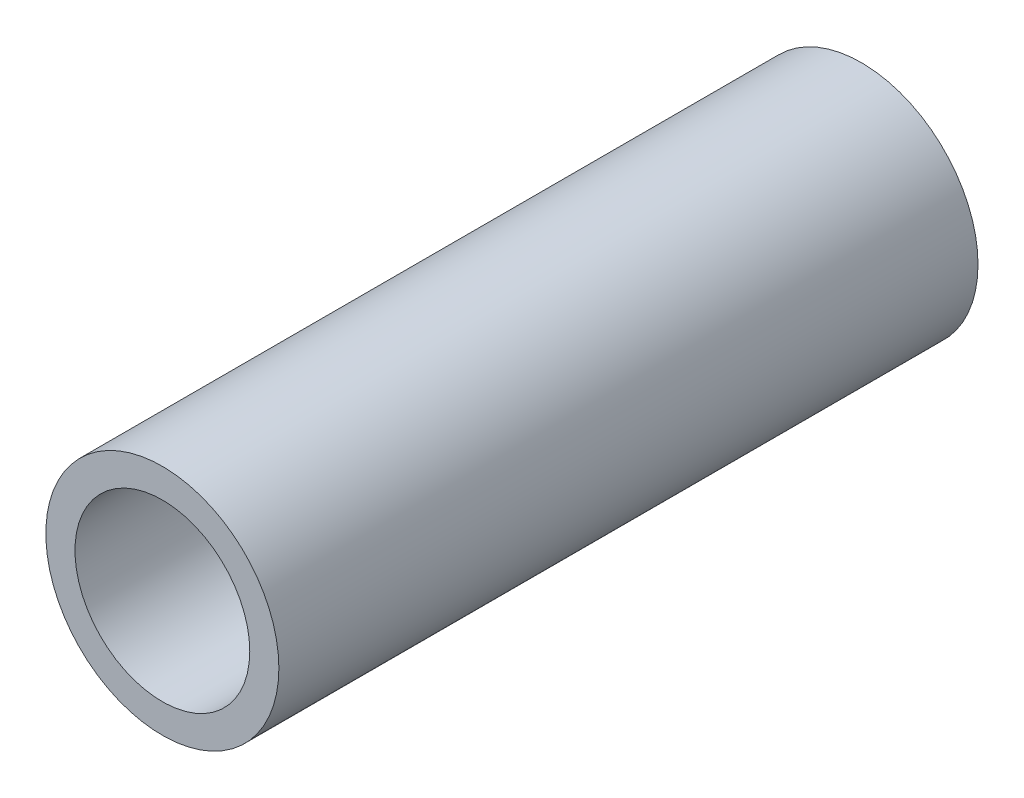
ISO-10303-21;
HEADER;
FILE_DESCRIPTION(('STEP AP214'),'2;1');
FILE_NAME('part.step','',(''),(''),'','','');
FILE_SCHEMA(('AUTOMOTIVE_DESIGN { 1 0 10303 214 1 1 1 1 }'));
ENDSEC;
DATA;
#1=APPLICATION_CONTEXT('core data for automotive mechanical design processes');
#2=APPLICATION_PROTOCOL_DEFINITION('international standard','automotive_design',2000,#1);
#3=PRODUCT_CONTEXT('',#1,'mechanical');
#4=PRODUCT('Part','Part','',(#3));
#5=PRODUCT_RELATED_PRODUCT_CATEGORY('part','',(#4));
#6=PRODUCT_DEFINITION_FORMATION('','',#4);
#7=PRODUCT_DEFINITION_CONTEXT('part definition',#1,'design');
#8=PRODUCT_DEFINITION('design','',#6,#7);
#9=PRODUCT_DEFINITION_SHAPE('','',#8);
#10=(LENGTH_UNIT() NAMED_UNIT(*) SI_UNIT(.MILLI.,.METRE.));
#11=(NAMED_UNIT(*) PLANE_ANGLE_UNIT() SI_UNIT($,.RADIAN.));
#12=(NAMED_UNIT(*) SI_UNIT($,.STERADIAN.) SOLID_ANGLE_UNIT());
#13=UNCERTAINTY_MEASURE_WITH_UNIT(LENGTH_MEASURE(1.E-05),#10,'distance_accuracy_value','');
#14=(GEOMETRIC_REPRESENTATION_CONTEXT(3) GLOBAL_UNCERTAINTY_ASSIGNED_CONTEXT((#13)) GLOBAL_UNIT_ASSIGNED_CONTEXT((#10,
#11,#12)) REPRESENTATION_CONTEXT('',''));
#15=CARTESIAN_POINT('',(0.,0.,0.));
#16=DIRECTION('',(0.,0.,1.));
#17=DIRECTION('',(1.,0.,0.));
#18=AXIS2_PLACEMENT_3D('',#15,#16,#17);
#19=CARTESIAN_POINT('',(0.,0.,25.4));
#20=DIRECTION('',(0.,0.,1.));
#21=DIRECTION('',(1.,0.,0.));
#22=AXIS2_PLACEMENT_3D('',#19,#20,#21);
#23=PLANE('',#22);
#24=CARTESIAN_POINT('',(0.,0.,25.4));
#25=DIRECTION('',(0.,0.,1.));
#26=DIRECTION('',(1.,0.,0.));
#27=AXIS2_PLACEMENT_3D('',#24,#25,#26);
#28=CIRCLE('',#27,4.23333333333333);
#29=CARTESIAN_POINT('',(4.23333333333333,0.,25.4));
#30=VERTEX_POINT('',#29);
#31=EDGE_CURVE('E10',#30,#30,#28,.T.);
#32=ORIENTED_EDGE('',*,*,#31,.T.);
#33=EDGE_LOOP('',(#32));
#34=FACE_BOUND('',#33,.T.);
#35=CARTESIAN_POINT('',(0.,0.,25.4));
#36=DIRECTION('',(0.,0.,1.));
#37=DIRECTION('',(1.,0.,0.));
#38=AXIS2_PLACEMENT_3D('',#35,#36,#37);
#39=CIRCLE('',#38,3.175);
#40=CARTESIAN_POINT('',(3.175,0.,25.4));
#41=VERTEX_POINT('',#40);
#42=EDGE_CURVE('E45',#41,#41,#39,.T.);
#43=ORIENTED_EDGE('',*,*,#42,.F.);
#44=EDGE_LOOP('',(#43));
#45=FACE_BOUND('',#44,.T.);
#46=ADVANCED_FACE('F34',(#34,#45),#23,.T.);
#47=CARTESIAN_POINT('',(0.,0.,0.));
#48=DIRECTION('',(0.,0.,1.));
#49=DIRECTION('',(1.,0.,0.));
#50=AXIS2_PLACEMENT_3D('',#47,#48,#49);
#51=PLANE('',#50);
#52=CARTESIAN_POINT('',(0.,0.,0.));
#53=DIRECTION('',(0.,0.,1.));
#54=DIRECTION('',(1.,0.,0.));
#55=AXIS2_PLACEMENT_3D('',#52,#53,#54);
#56=CIRCLE('',#55,4.23333333333333);
#57=CARTESIAN_POINT('',(4.23333333333333,0.,0.));
#58=VERTEX_POINT('',#57);
#59=EDGE_CURVE('E38',#58,#58,#56,.T.);
#60=ORIENTED_EDGE('',*,*,#59,.F.);
#61=EDGE_LOOP('',(#60));
#62=FACE_BOUND('',#61,.T.);
#63=CARTESIAN_POINT('',(0.,0.,0.));
#64=DIRECTION('',(0.,0.,1.));
#65=DIRECTION('',(1.,0.,0.));
#66=AXIS2_PLACEMENT_3D('',#63,#64,#65);
#67=CIRCLE('',#66,3.175);
#68=CARTESIAN_POINT('',(3.175,0.,0.));
#69=VERTEX_POINT('',#68);
#70=EDGE_CURVE('E47',#69,#69,#67,.T.);
#71=ORIENTED_EDGE('',*,*,#70,.T.);
#72=EDGE_LOOP('',(#71));
#73=FACE_BOUND('',#72,.T.);
#74=ADVANCED_FACE('F57',(#62,#73),#51,.F.);
#75=CARTESIAN_POINT('',(0.,0.,25.4));
#76=DIRECTION('',(0.,0.,-1.));
#77=DIRECTION('',(-1.,0.,0.));
#78=AXIS2_PLACEMENT_3D('',#75,#76,#77);
#79=CYLINDRICAL_SURFACE('',#78,4.23333333333333);
#80=ORIENTED_EDGE('',*,*,#31,.F.);
#81=EDGE_LOOP('',(#80));
#82=FACE_BOUND('',#81,.T.);
#83=ORIENTED_EDGE('',*,*,#59,.T.);
#84=EDGE_LOOP('',(#83));
#85=FACE_BOUND('',#84,.T.);
#86=ADVANCED_FACE('F36',(#82,#85),#79,.T.);
#87=CARTESIAN_POINT('',(0.,0.,25.4));
#88=DIRECTION('',(0.,0.,-1.));
#89=DIRECTION('',(-1.,0.,0.));
#90=AXIS2_PLACEMENT_3D('',#87,#88,#89);
#91=CYLINDRICAL_SURFACE('',#90,3.175);
#92=ORIENTED_EDGE('',*,*,#42,.T.);
#93=EDGE_LOOP('',(#92));
#94=FACE_BOUND('',#93,.T.);
#95=ORIENTED_EDGE('',*,*,#70,.F.);
#96=EDGE_LOOP('',(#95));
#97=FACE_BOUND('',#96,.T.);
#98=ADVANCED_FACE('F53',(#94,#97),#91,.F.);
#99=CLOSED_SHELL('',(#46,#74,#86,#98));
#100=MANIFOLD_SOLID_BREP('B2',#99);
#101=ADVANCED_BREP_SHAPE_REPRESENTATION('',(#18,#100),#14);
#102=SHAPE_DEFINITION_REPRESENTATION(#9,#101);
ENDSEC;
END-ISO-10303-21;
